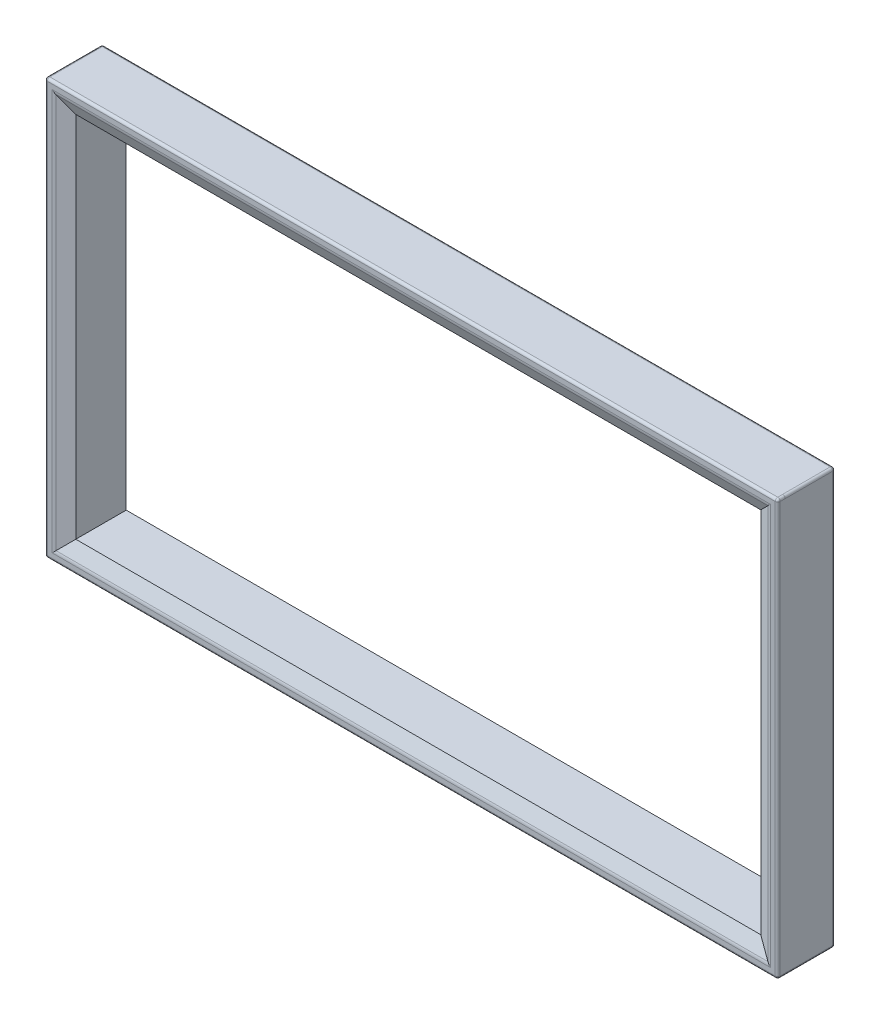
ISO-10303-21;
HEADER;
FILE_DESCRIPTION(('STEP AP214'),'2;1');
FILE_NAME('part.step','',(''),(''),'','','');
FILE_SCHEMA(('AUTOMOTIVE_DESIGN { 1 0 10303 214 1 1 1 1 }'));
ENDSEC;
DATA;
#1=APPLICATION_CONTEXT('core data for automotive mechanical design processes');
#2=APPLICATION_PROTOCOL_DEFINITION('international standard','automotive_design',2000,#1);
#3=PRODUCT_CONTEXT('',#1,'mechanical');
#4=PRODUCT('Part','Part','',(#3));
#5=PRODUCT_RELATED_PRODUCT_CATEGORY('part','',(#4));
#6=PRODUCT_DEFINITION_FORMATION('','',#4);
#7=PRODUCT_DEFINITION_CONTEXT('part definition',#1,'design');
#8=PRODUCT_DEFINITION('design','',#6,#7);
#9=PRODUCT_DEFINITION_SHAPE('','',#8);
#10=(LENGTH_UNIT() NAMED_UNIT(*) SI_UNIT(.MILLI.,.METRE.));
#11=(NAMED_UNIT(*) PLANE_ANGLE_UNIT() SI_UNIT($,.RADIAN.));
#12=(NAMED_UNIT(*) SI_UNIT($,.STERADIAN.) SOLID_ANGLE_UNIT());
#13=UNCERTAINTY_MEASURE_WITH_UNIT(LENGTH_MEASURE(1.E-05),#10,'distance_accuracy_value','');
#14=(GEOMETRIC_REPRESENTATION_CONTEXT(3) GLOBAL_UNCERTAINTY_ASSIGNED_CONTEXT((#13)) GLOBAL_UNIT_ASSIGNED_CONTEXT((#10,
#11,#12)) REPRESENTATION_CONTEXT('',''));
#15=CARTESIAN_POINT('',(0.,0.,0.));
#16=DIRECTION('',(0.,0.,1.));
#17=DIRECTION('',(1.,0.,0.));
#18=AXIS2_PLACEMENT_3D('',#15,#16,#17);
#19=CARTESIAN_POINT('',(0.,0.,423.));
#20=DIRECTION('',(0.,0.,-1.));
#21=DIRECTION('',(-1.,0.,0.));
#22=AXIS2_PLACEMENT_3D('',#19,#20,#21);
#23=PLANE('',#22);
#24=DIRECTION('',(0.,-1.,0.));
#25=VECTOR('',#24,1.);
#26=CARTESIAN_POINT('',(-1524.24781139835,0.,423.));
#27=LINE('',#26,#25);
#28=CARTESIAN_POINT('',(-1524.24781139835,822.873149236193,423.));
#29=VERTEX_POINT('',#28);
#30=CARTESIAN_POINT('',(-1524.24781139835,-823.126850763807,423.));
#31=VERTEX_POINT('',#30);
#32=EDGE_CURVE('E318',#29,#31,#27,.T.);
#33=ORIENTED_EDGE('',*,*,#32,.T.);
#34=DIRECTION('',(1.,0.,0.));
#35=VECTOR('',#34,1.);
#36=CARTESIAN_POINT('',(0.,-823.126850763807,423.));
#37=LINE('',#36,#35);
#38=CARTESIAN_POINT('',(1391.75218860164,-823.126850763807,423.));
#39=VERTEX_POINT('',#38);
#40=EDGE_CURVE('E324',#31,#39,#37,.T.);
#41=ORIENTED_EDGE('',*,*,#40,.T.);
#42=DIRECTION('',(0.,1.,0.));
#43=VECTOR('',#42,1.);
#44=CARTESIAN_POINT('',(1391.75218860164,0.,423.));
#45=LINE('',#44,#43);
#46=CARTESIAN_POINT('',(1391.75218860164,822.873149236193,423.));
#47=VERTEX_POINT('',#46);
#48=EDGE_CURVE('E322',#39,#47,#45,.T.);
#49=ORIENTED_EDGE('',*,*,#48,.T.);
#50=DIRECTION('',(-1.,0.,0.));
#51=VECTOR('',#50,1.);
#52=CARTESIAN_POINT('',(0.,822.873149236193,423.));
#53=LINE('',#52,#51);
#54=EDGE_CURVE('E320',#47,#29,#53,.T.);
#55=ORIENTED_EDGE('',*,*,#54,.T.);
#56=EDGE_LOOP('',(#33,#41,#49,#55));
#57=FACE_BOUND('',#56,.T.);
#58=DIRECTION('',(0.,1.,0.));
#59=VECTOR('',#58,1.);
#60=CARTESIAN_POINT('',(-1504.89865127764,796.873149236193,423.));
#61=LINE('',#60,#59);
#62=CARTESIAN_POINT('',(-1504.89865127764,-803.777690643096,423.));
#63=VERTEX_POINT('',#62);
#64=CARTESIAN_POINT('',(-1504.89865127764,803.523989115481,423.));
#65=VERTEX_POINT('',#64);
#66=EDGE_CURVE('E238',#63,#65,#61,.T.);
#67=ORIENTED_EDGE('',*,*,#66,.T.);
#68=DIRECTION('',(1.,0.,0.));
#69=VECTOR('',#68,1.);
#70=CARTESIAN_POINT('',(1365.75218860164,803.523989115481,423.));
#71=LINE('',#70,#69);
#72=CARTESIAN_POINT('',(1372.40302848093,803.523989115481,423.));
#73=VERTEX_POINT('',#72);
#74=EDGE_CURVE('E254',#65,#73,#71,.T.);
#75=ORIENTED_EDGE('',*,*,#74,.T.);
#76=DIRECTION('',(0.,-1.,0.));
#77=VECTOR('',#76,1.);
#78=CARTESIAN_POINT('',(1372.40302848093,-797.126850763808,423.));
#79=LINE('',#78,#77);
#80=CARTESIAN_POINT('',(1372.40302848093,-803.777690643096,423.));
#81=VERTEX_POINT('',#80);
#82=EDGE_CURVE('E252',#73,#81,#79,.T.);
#83=ORIENTED_EDGE('',*,*,#82,.T.);
#84=DIRECTION('',(-1.,0.,0.));
#85=VECTOR('',#84,1.);
#86=CARTESIAN_POINT('',(-1498.24781139836,-803.777690643096,423.));
#87=LINE('',#86,#85);
#88=EDGE_CURVE('E250',#81,#63,#87,.T.);
#89=ORIENTED_EDGE('',*,*,#88,.T.);
#90=EDGE_LOOP('',(#67,#75,#83,#89));
#91=FACE_BOUND('',#90,.T.);
#92=ADVANCED_FACE('F34',(#57,#91),#23,.F.);
#93=CARTESIAN_POINT('',(1401.75218860164,-833.126850763807,423.));
#94=DIRECTION('',(-1.,0.,0.));
#95=DIRECTION('',(0.,0.,1.));
#96=AXIS2_PLACEMENT_3D('',#93,#94,#95);
#97=PLANE('',#96);
#98=DIRECTION('',(0.,0.,-1.));
#99=VECTOR('',#98,1.);
#100=CARTESIAN_POINT('',(1401.75218860164,-823.126850763807,423.));
#101=LINE('',#100,#99);
#102=CARTESIAN_POINT('',(1401.75218860164,-823.126850763807,413.));
#103=VERTEX_POINT('',#102);
#104=CARTESIAN_POINT('',(1401.75218860164,-823.126850763807,393.));
#105=VERTEX_POINT('',#104);
#106=EDGE_CURVE('E288',#103,#105,#101,.T.);
#107=ORIENTED_EDGE('',*,*,#106,.T.);
#108=DIRECTION('',(0.,0.,1.));
#109=VECTOR('',#108,1.);
#110=CARTESIAN_POINT('',(1401.75218860164,-823.126850763807,423.));
#111=LINE('',#110,#109);
#112=CARTESIAN_POINT('',(1401.75218860164,-823.126850763807,203.));
#113=VERTEX_POINT('',#112);
#114=EDGE_CURVE('E428',#105,#113,#111,.F.);
#115=ORIENTED_EDGE('',*,*,#114,.T.);
#116=DIRECTION('',(0.,-1.,0.));
#117=VECTOR('',#116,1.);
#118=CARTESIAN_POINT('',(1401.75218860164,-833.126850763807,203.));
#119=LINE('',#118,#117);
#120=CARTESIAN_POINT('',(1401.75218860164,822.873149236193,203.));
#121=VERTEX_POINT('',#120);
#122=EDGE_CURVE('E424',#113,#121,#119,.F.);
#123=ORIENTED_EDGE('',*,*,#122,.T.);
#124=DIRECTION('',(0.,0.,1.));
#125=VECTOR('',#124,1.);
#126=CARTESIAN_POINT('',(1401.75218860164,822.873149236193,423.));
#127=LINE('',#126,#125);
#128=CARTESIAN_POINT('',(1401.75218860164,822.873149236193,393.));
#129=VERTEX_POINT('',#128);
#130=EDGE_CURVE('E422',#121,#129,#127,.T.);
#131=ORIENTED_EDGE('',*,*,#130,.T.);
#132=DIRECTION('',(0.,0.,-1.));
#133=VECTOR('',#132,1.);
#134=CARTESIAN_POINT('',(1401.75218860164,822.873149236193,423.));
#135=LINE('',#134,#133);
#136=CARTESIAN_POINT('',(1401.75218860164,822.873149236193,413.));
#137=VERTEX_POINT('',#136);
#138=EDGE_CURVE('E278',#129,#137,#135,.F.);
#139=ORIENTED_EDGE('',*,*,#138,.T.);
#140=DIRECTION('',(0.,1.,0.));
#141=VECTOR('',#140,1.);
#142=CARTESIAN_POINT('',(1401.75218860164,-833.126850763807,413.));
#143=LINE('',#142,#141);
#144=EDGE_CURVE('E266',#137,#103,#143,.F.);
#145=ORIENTED_EDGE('',*,*,#144,.T.);
#146=EDGE_LOOP('',(#107,#115,#123,#131,#139,#145));
#147=FACE_BOUND('',#146,.T.);
#148=ADVANCED_FACE('F481',(#147),#97,.F.);
#149=CARTESIAN_POINT('',(-1534.24781139835,832.873149236193,423.));
#150=DIRECTION('',(0.,-1.,0.));
#151=DIRECTION('',(0.,0.,-1.));
#152=AXIS2_PLACEMENT_3D('',#149,#150,#151);
#153=PLANE('',#152);
#154=DIRECTION('',(0.,0.,-1.));
#155=VECTOR('',#154,1.);
#156=CARTESIAN_POINT('',(1391.75218860164,832.873149236193,423.));
#157=LINE('',#156,#155);
#158=CARTESIAN_POINT('',(1391.75218860164,832.873149236193,413.));
#159=VERTEX_POINT('',#158);
#160=CARTESIAN_POINT('',(1391.75218860164,832.873149236193,393.));
#161=VERTEX_POINT('',#160);
#162=EDGE_CURVE('E317',#159,#161,#157,.T.);
#163=ORIENTED_EDGE('',*,*,#162,.T.);
#164=DIRECTION('',(0.,0.,1.));
#165=VECTOR('',#164,1.);
#166=CARTESIAN_POINT('',(1391.75218860164,832.873149236193,423.));
#167=LINE('',#166,#165);
#168=CARTESIAN_POINT('',(1391.75218860164,832.873149236193,203.));
#169=VERTEX_POINT('',#168);
#170=EDGE_CURVE('E11',#161,#169,#167,.F.);
#171=ORIENTED_EDGE('',*,*,#170,.T.);
#172=DIRECTION('',(1.,0.,0.));
#173=VECTOR('',#172,1.);
#174=CARTESIAN_POINT('',(-1534.24781139835,832.873149236193,203.));
#175=LINE('',#174,#173);
#176=CARTESIAN_POINT('',(-1524.24781139835,832.873149236193,203.));
#177=VERTEX_POINT('',#176);
#178=EDGE_CURVE('E43',#169,#177,#175,.F.);
#179=ORIENTED_EDGE('',*,*,#178,.T.);
#180=DIRECTION('',(0.,0.,1.));
#181=VECTOR('',#180,1.);
#182=CARTESIAN_POINT('',(-1524.24781139835,832.873149236193,423.));
#183=LINE('',#182,#181);
#184=CARTESIAN_POINT('',(-1524.24781139835,832.873149236193,393.));
#185=VERTEX_POINT('',#184);
#186=EDGE_CURVE('E430',#177,#185,#183,.T.);
#187=ORIENTED_EDGE('',*,*,#186,.T.);
#188=DIRECTION('',(0.,0.,-1.));
#189=VECTOR('',#188,1.);
#190=CARTESIAN_POINT('',(-1524.24781139835,832.873149236193,423.));
#191=LINE('',#190,#189);
#192=CARTESIAN_POINT('',(-1524.24781139835,832.873149236193,413.));
#193=VERTEX_POINT('',#192);
#194=EDGE_CURVE('E315',#185,#193,#191,.F.);
#195=ORIENTED_EDGE('',*,*,#194,.T.);
#196=DIRECTION('',(-1.,0.,0.));
#197=VECTOR('',#196,1.);
#198=CARTESIAN_POINT('',(-1534.24781139835,832.873149236193,413.));
#199=LINE('',#198,#197);
#200=EDGE_CURVE('E313',#193,#159,#199,.F.);
#201=ORIENTED_EDGE('',*,*,#200,.T.);
#202=EDGE_LOOP('',(#163,#171,#179,#187,#195,#201));
#203=FACE_BOUND('',#202,.T.);
#204=ADVANCED_FACE('F547',(#203),#153,.F.);
#205=CARTESIAN_POINT('',(-1534.24781139835,-833.126850763807,423.));
#206=DIRECTION('',(1.,0.,0.));
#207=DIRECTION('',(0.,0.,-1.));
#208=AXIS2_PLACEMENT_3D('',#205,#206,#207);
#209=PLANE('',#208);
#210=DIRECTION('',(0.,1.,0.));
#211=VECTOR('',#210,1.);
#212=CARTESIAN_POINT('',(-1534.24781139835,-833.126850763807,203.));
#213=LINE('',#212,#211);
#214=CARTESIAN_POINT('',(-1534.24781139835,822.873149236193,203.));
#215=VERTEX_POINT('',#214);
#216=CARTESIAN_POINT('',(-1534.24781139835,-823.126850763807,203.));
#217=VERTEX_POINT('',#216);
#218=EDGE_CURVE('E389',#215,#217,#213,.F.);
#219=ORIENTED_EDGE('',*,*,#218,.T.);
#220=DIRECTION('',(0.,0.,1.));
#221=VECTOR('',#220,1.);
#222=CARTESIAN_POINT('',(-1534.24781139835,-823.126850763807,423.));
#223=LINE('',#222,#221);
#224=CARTESIAN_POINT('',(-1534.24781139835,-823.126850763807,393.));
#225=VERTEX_POINT('',#224);
#226=EDGE_CURVE('E391',#217,#225,#223,.T.);
#227=ORIENTED_EDGE('',*,*,#226,.T.);
#228=DIRECTION('',(0.,0.,-1.));
#229=VECTOR('',#228,1.);
#230=CARTESIAN_POINT('',(-1534.24781139835,-823.126850763807,423.));
#231=LINE('',#230,#229);
#232=CARTESIAN_POINT('',(-1534.24781139835,-823.126850763807,413.));
#233=VERTEX_POINT('',#232);
#234=EDGE_CURVE('E291',#225,#233,#231,.F.);
#235=ORIENTED_EDGE('',*,*,#234,.T.);
#236=DIRECTION('',(0.,-1.,0.));
#237=VECTOR('',#236,1.);
#238=CARTESIAN_POINT('',(-1534.24781139835,-833.126850763807,413.));
#239=LINE('',#238,#237);
#240=CARTESIAN_POINT('',(-1534.24781139835,822.873149236193,413.));
#241=VERTEX_POINT('',#240);
#242=EDGE_CURVE('E294',#233,#241,#239,.F.);
#243=ORIENTED_EDGE('',*,*,#242,.T.);
#244=DIRECTION('',(0.,0.,-1.));
#245=VECTOR('',#244,1.);
#246=CARTESIAN_POINT('',(-1534.24781139835,822.873149236193,423.));
#247=LINE('',#246,#245);
#248=CARTESIAN_POINT('',(-1534.24781139835,822.873149236193,393.));
#249=VERTEX_POINT('',#248);
#250=EDGE_CURVE('E293',#241,#249,#247,.T.);
#251=ORIENTED_EDGE('',*,*,#250,.T.);
#252=DIRECTION('',(0.,0.,1.));
#253=VECTOR('',#252,1.);
#254=CARTESIAN_POINT('',(-1534.24781139835,822.873149236193,423.));
#255=LINE('',#254,#253);
#256=EDGE_CURVE('E327',#249,#215,#255,.F.);
#257=ORIENTED_EDGE('',*,*,#256,.T.);
#258=EDGE_LOOP('',(#219,#227,#235,#243,#251,#257));
#259=FACE_BOUND('',#258,.T.);
#260=ADVANCED_FACE('F376',(#259),#209,.F.);
#261=CARTESIAN_POINT('',(-1534.24781139835,-833.126850763807,423.));
#262=DIRECTION('',(0.,1.,0.));
#263=DIRECTION('',(0.,0.,1.));
#264=AXIS2_PLACEMENT_3D('',#261,#262,#263);
#265=PLANE('',#264);
#266=DIRECTION('',(0.,0.,-1.));
#267=VECTOR('',#266,1.);
#268=CARTESIAN_POINT('',(-1524.24781139835,-833.126850763807,423.));
#269=LINE('',#268,#267);
#270=CARTESIAN_POINT('',(-1524.24781139835,-833.126850763807,413.));
#271=VERTEX_POINT('',#270);
#272=CARTESIAN_POINT('',(-1524.24781139835,-833.126850763807,393.));
#273=VERTEX_POINT('',#272);
#274=EDGE_CURVE('E297',#271,#273,#269,.T.);
#275=ORIENTED_EDGE('',*,*,#274,.T.);
#276=DIRECTION('',(0.,0.,1.));
#277=VECTOR('',#276,1.);
#278=CARTESIAN_POINT('',(-1524.24781139835,-833.126850763807,423.));
#279=LINE('',#278,#277);
#280=CARTESIAN_POINT('',(-1524.24781139835,-833.126850763807,203.));
#281=VERTEX_POINT('',#280);
#282=EDGE_CURVE('E409',#273,#281,#279,.F.);
#283=ORIENTED_EDGE('',*,*,#282,.T.);
#284=DIRECTION('',(-1.,0.,0.));
#285=VECTOR('',#284,1.);
#286=CARTESIAN_POINT('',(-1534.24781139835,-833.126850763807,203.));
#287=LINE('',#286,#285);
#288=CARTESIAN_POINT('',(1391.75218860164,-833.126850763807,203.));
#289=VERTEX_POINT('',#288);
#290=EDGE_CURVE('E405',#281,#289,#287,.F.);
#291=ORIENTED_EDGE('',*,*,#290,.T.);
#292=DIRECTION('',(0.,0.,1.));
#293=VECTOR('',#292,1.);
#294=CARTESIAN_POINT('',(1391.75218860164,-833.126850763807,423.));
#295=LINE('',#294,#293);
#296=CARTESIAN_POINT('',(1391.75218860164,-833.126850763807,393.));
#297=VERTEX_POINT('',#296);
#298=EDGE_CURVE('E401',#289,#297,#295,.T.);
#299=ORIENTED_EDGE('',*,*,#298,.T.);
#300=DIRECTION('',(0.,0.,-1.));
#301=VECTOR('',#300,1.);
#302=CARTESIAN_POINT('',(1391.75218860164,-833.126850763807,423.));
#303=LINE('',#302,#301);
#304=CARTESIAN_POINT('',(1391.75218860164,-833.126850763807,413.));
#305=VERTEX_POINT('',#304);
#306=EDGE_CURVE('E299',#297,#305,#303,.F.);
#307=ORIENTED_EDGE('',*,*,#306,.T.);
#308=DIRECTION('',(1.,0.,0.));
#309=VECTOR('',#308,1.);
#310=CARTESIAN_POINT('',(-1534.24781139835,-833.126850763807,413.));
#311=LINE('',#310,#309);
#312=EDGE_CURVE('E300',#305,#271,#311,.F.);
#313=ORIENTED_EDGE('',*,*,#312,.T.);
#314=EDGE_LOOP('',(#275,#283,#291,#299,#307,#313));
#315=FACE_BOUND('',#314,.T.);
#316=ADVANCED_FACE('F554',(#315),#265,.F.);
#317=CARTESIAN_POINT('',(1305.75218860164,-737.126850763807,423.));
#318=DIRECTION('',(-1.,0.,0.));
#319=DIRECTION('',(0.,0.,1.));
#320=AXIS2_PLACEMENT_3D('',#317,#318,#319);
#321=PLANE('',#320);
#322=DIRECTION('',(0.,0.,-1.));
#323=VECTOR('',#322,1.);
#324=CARTESIAN_POINT('',(1305.75218860164,-737.126850763807,423.));
#325=LINE('',#324,#323);
#326=CARTESIAN_POINT('',(1305.75218860164,-737.126850763807,395.0215405107));
#327=VERTEX_POINT('',#326);
#328=CARTESIAN_POINT('',(1305.75218860164,-737.126850763807,193.));
#329=VERTEX_POINT('',#328);
#330=EDGE_CURVE('E194',#327,#329,#325,.T.);
#331=ORIENTED_EDGE('',*,*,#330,.F.);
#332=DIRECTION('',(0.,1.,0.));
#333=VECTOR('',#332,1.);
#334=CARTESIAN_POINT('',(1305.75218860164,736.873149236193,395.0215405107));
#335=LINE('',#334,#333);
#336=CARTESIAN_POINT('',(1305.75218860164,736.873149236193,395.0215405107));
#337=VERTEX_POINT('',#336);
#338=EDGE_CURVE('E235',#327,#337,#335,.T.);
#339=ORIENTED_EDGE('',*,*,#338,.T.);
#340=DIRECTION('',(0.,0.,-1.));
#341=VECTOR('',#340,1.);
#342=CARTESIAN_POINT('',(1305.75218860164,736.873149236193,423.));
#343=LINE('',#342,#341);
#344=CARTESIAN_POINT('',(1305.75218860164,736.873149236193,193.));
#345=VERTEX_POINT('',#344);
#346=EDGE_CURVE('E212',#337,#345,#343,.T.);
#347=ORIENTED_EDGE('',*,*,#346,.T.);
#348=DIRECTION('',(0.,-1.,0.));
#349=VECTOR('',#348,1.);
#350=CARTESIAN_POINT('',(1305.75218860164,-737.126850763807,193.));
#351=LINE('',#350,#349);
#352=EDGE_CURVE('E209',#345,#329,#351,.T.);
#353=ORIENTED_EDGE('',*,*,#352,.T.);
#354=EDGE_LOOP('',(#331,#339,#347,#353));
#355=FACE_BOUND('',#354,.T.);
#356=ADVANCED_FACE('F210',(#355),#321,.T.);
#357=CARTESIAN_POINT('',(-1438.24781139836,736.873149236193,423.));
#358=DIRECTION('',(0.,-1.,0.));
#359=DIRECTION('',(0.,0.,-1.));
#360=AXIS2_PLACEMENT_3D('',#357,#358,#359);
#361=PLANE('',#360);
#362=ORIENTED_EDGE('',*,*,#346,.F.);
#363=DIRECTION('',(-1.,0.,0.));
#364=VECTOR('',#363,1.);
#365=CARTESIAN_POINT('',(-1438.24781139836,736.873149236193,395.0215405107));
#366=LINE('',#365,#364);
#367=CARTESIAN_POINT('',(-1438.24781139836,736.873149236193,395.0215405107));
#368=VERTEX_POINT('',#367);
#369=EDGE_CURVE('E233',#337,#368,#366,.T.);
#370=ORIENTED_EDGE('',*,*,#369,.T.);
#371=DIRECTION('',(0.,0.,-1.));
#372=VECTOR('',#371,1.);
#373=CARTESIAN_POINT('',(-1438.24781139836,736.873149236193,423.));
#374=LINE('',#373,#372);
#375=CARTESIAN_POINT('',(-1438.24781139835,736.873149236193,193.));
#376=VERTEX_POINT('',#375);
#377=EDGE_CURVE('E227',#368,#376,#374,.T.);
#378=ORIENTED_EDGE('',*,*,#377,.T.);
#379=DIRECTION('',(1.,0.,0.));
#380=VECTOR('',#379,1.);
#381=CARTESIAN_POINT('',(-1438.24781139835,736.873149236193,193.));
#382=LINE('',#381,#380);
#383=EDGE_CURVE('E221',#376,#345,#382,.T.);
#384=ORIENTED_EDGE('',*,*,#383,.T.);
#385=EDGE_LOOP('',(#362,#370,#378,#384));
#386=FACE_BOUND('',#385,.T.);
#387=ADVANCED_FACE('F571',(#386),#361,.T.);
#388=CARTESIAN_POINT('',(-1438.24781139836,-737.126850763807,423.));
#389=DIRECTION('',(1.,0.,0.));
#390=DIRECTION('',(0.,0.,-1.));
#391=AXIS2_PLACEMENT_3D('',#388,#389,#390);
#392=PLANE('',#391);
#393=ORIENTED_EDGE('',*,*,#377,.F.);
#394=DIRECTION('',(0.,-1.,0.));
#395=VECTOR('',#394,1.);
#396=CARTESIAN_POINT('',(-1438.24781139836,-737.126850763807,395.0215405107));
#397=LINE('',#396,#395);
#398=CARTESIAN_POINT('',(-1438.24781139836,-737.126850763807,395.0215405107));
#399=VERTEX_POINT('',#398);
#400=EDGE_CURVE('E230',#368,#399,#397,.T.);
#401=ORIENTED_EDGE('',*,*,#400,.T.);
#402=DIRECTION('',(0.,0.,-1.));
#403=VECTOR('',#402,1.);
#404=CARTESIAN_POINT('',(-1438.24781139836,-737.126850763807,423.));
#405=LINE('',#404,#403);
#406=CARTESIAN_POINT('',(-1438.24781139835,-737.126850763807,193.));
#407=VERTEX_POINT('',#406);
#408=EDGE_CURVE('E205',#399,#407,#405,.T.);
#409=ORIENTED_EDGE('',*,*,#408,.T.);
#410=DIRECTION('',(0.,1.,0.));
#411=VECTOR('',#410,1.);
#412=CARTESIAN_POINT('',(-1438.24781139835,-737.126850763807,193.));
#413=LINE('',#412,#411);
#414=EDGE_CURVE('E219',#407,#376,#413,.T.);
#415=ORIENTED_EDGE('',*,*,#414,.T.);
#416=EDGE_LOOP('',(#393,#401,#409,#415));
#417=FACE_BOUND('',#416,.T.);
#418=ADVANCED_FACE('F712',(#417),#392,.T.);
#419=CARTESIAN_POINT('',(-1438.24781139836,-737.126850763807,423.));
#420=DIRECTION('',(0.,1.,0.));
#421=DIRECTION('',(0.,0.,1.));
#422=AXIS2_PLACEMENT_3D('',#419,#420,#421);
#423=PLANE('',#422);
#424=ORIENTED_EDGE('',*,*,#408,.F.);
#425=DIRECTION('',(1.,0.,0.));
#426=VECTOR('',#425,1.);
#427=CARTESIAN_POINT('',(1305.75218860164,-737.126850763807,395.0215405107));
#428=LINE('',#427,#426);
#429=EDGE_CURVE('E202',#399,#327,#428,.T.);
#430=ORIENTED_EDGE('',*,*,#429,.T.);
#431=ORIENTED_EDGE('',*,*,#330,.T.);
#432=DIRECTION('',(-1.,0.,0.));
#433=VECTOR('',#432,1.);
#434=CARTESIAN_POINT('',(-1438.24781139835,-737.126850763807,193.));
#435=LINE('',#434,#433);
#436=EDGE_CURVE('E199',#329,#407,#435,.T.);
#437=ORIENTED_EDGE('',*,*,#436,.T.);
#438=EDGE_LOOP('',(#424,#430,#431,#437));
#439=FACE_BOUND('',#438,.T.);
#440=ADVANCED_FACE('F197',(#439),#423,.T.);
#441=CARTESIAN_POINT('',(1305.75218860164,-737.126850763807,395.0215405107));
#442=DIRECTION('',(-0.422618261740698,0.,0.906307787036651));
#443=DIRECTION('',(0.,-1.,0.));
#444=AXIS2_PLACEMENT_3D('',#441,#442,#443);
#445=PLANE('',#444);
#446=DIRECTION('',(-0.671542934237818,0.671542934237818,-0.313145613014972));
#447=VECTOR('',#446,1.);
#448=CARTESIAN_POINT('',(1305.75218860164,-737.126850763807,395.0215405107));
#449=LINE('',#448,#447);
#450=CARTESIAN_POINT('',(1359.72448062871,-791.099142790875,420.189233611099));
#451=VERTEX_POINT('',#450);
#452=EDGE_CURVE('E245',#451,#327,#449,.T.);
#453=ORIENTED_EDGE('',*,*,#452,.F.);
#454=DIRECTION('',(0.,-1.,0.));
#455=VECTOR('',#454,1.);
#456=CARTESIAN_POINT('',(1359.72448062871,796.873149236193,420.1892336111));
#457=LINE('',#456,#455);
#458=CARTESIAN_POINT('',(1359.72448062871,790.845441263261,420.189233611099));
#459=VERTEX_POINT('',#458);
#460=EDGE_CURVE('E260',#451,#459,#457,.F.);
#461=ORIENTED_EDGE('',*,*,#460,.T.);
#462=DIRECTION('',(-0.671542934237818,-0.671542934237818,-0.313145613014972));
#463=VECTOR('',#462,1.);
#464=CARTESIAN_POINT('',(68.2907486337609,-500.58829073169,-182.016205617833));
#465=LINE('',#464,#463);
#466=EDGE_CURVE('E206',#337,#459,#465,.F.);
#467=ORIENTED_EDGE('',*,*,#466,.F.);
#468=ORIENTED_EDGE('',*,*,#338,.F.);
#469=EDGE_LOOP('',(#453,#461,#467,#468));
#470=FACE_BOUND('',#469,.T.);
#471=ADVANCED_FACE('F711',(#470),#445,.T.);
#472=CARTESIAN_POINT('',(-1438.24781139836,736.873149236193,395.0215405107));
#473=DIRECTION('',(0.,-0.422618261740698,0.906307787036651));
#474=DIRECTION('',(1.,0.,0.));
#475=AXIS2_PLACEMENT_3D('',#472,#473,#474);
#476=PLANE('',#475);
#477=ORIENTED_EDGE('',*,*,#466,.T.);
#478=DIRECTION('',(1.,0.,0.));
#479=VECTOR('',#478,1.);
#480=CARTESIAN_POINT('',(-1498.24781139836,790.84544126326,420.189233611099));
#481=LINE('',#480,#479);
#482=CARTESIAN_POINT('',(-1492.22010342542,790.84544126326,420.189233611099));
#483=VERTEX_POINT('',#482);
#484=EDGE_CURVE('E257',#459,#483,#481,.F.);
#485=ORIENTED_EDGE('',*,*,#484,.T.);
#486=DIRECTION('',(0.671542934237818,-0.671542934237818,-0.313145613014972));
#487=VECTOR('',#486,1.);
#488=CARTESIAN_POINT('',(-773.51816033689,72.1434981747278,85.0530136180404));
#489=LINE('',#488,#487);
#490=EDGE_CURVE('E241',#368,#483,#489,.F.);
#491=ORIENTED_EDGE('',*,*,#490,.F.);
#492=ORIENTED_EDGE('',*,*,#369,.F.);
#493=EDGE_LOOP('',(#477,#485,#491,#492));
#494=FACE_BOUND('',#493,.T.);
#495=ADVANCED_FACE('F840',(#494),#476,.T.);
#496=CARTESIAN_POINT('',(-1438.24781139836,-737.126850763807,395.0215405107));
#497=DIRECTION('',(0.,0.422618261740698,0.906307787036651));
#498=DIRECTION('',(-1.,0.,0.));
#499=AXIS2_PLACEMENT_3D('',#496,#497,#498);
#500=PLANE('',#499);
#501=DIRECTION('',(-0.671542934237818,-0.671542934237818,0.313145613014972));
#502=VECTOR('',#501,1.);
#503=CARTESIAN_POINT('',(-1438.24781139836,-737.126850763807,395.0215405107));
#504=LINE('',#503,#502);
#505=CARTESIAN_POINT('',(-1492.22010342542,-791.099142790875,420.189233611099));
#506=VERTEX_POINT('',#505);
#507=EDGE_CURVE('E239',#506,#399,#504,.F.);
#508=ORIENTED_EDGE('',*,*,#507,.F.);
#509=DIRECTION('',(-1.,0.,0.));
#510=VECTOR('',#509,1.);
#511=CARTESIAN_POINT('',(1365.75218860164,-791.099142790875,420.189233611099));
#512=LINE('',#511,#510);
#513=EDGE_CURVE('E262',#506,#451,#512,.F.);
#514=ORIENTED_EDGE('',*,*,#513,.T.);
#515=ORIENTED_EDGE('',*,*,#452,.T.);
#516=ORIENTED_EDGE('',*,*,#429,.F.);
#517=EDGE_LOOP('',(#508,#514,#515,#516));
#518=FACE_BOUND('',#517,.T.);
#519=ADVANCED_FACE('F830',(#518),#500,.T.);
#520=CARTESIAN_POINT('',(-1438.24781139836,-737.126850763807,395.0215405107));
#521=DIRECTION('',(0.422618261740698,0.,0.906307787036651));
#522=DIRECTION('',(0.,1.,0.));
#523=AXIS2_PLACEMENT_3D('',#520,#521,#522);
#524=PLANE('',#523);
#525=ORIENTED_EDGE('',*,*,#490,.T.);
#526=DIRECTION('',(0.,1.,0.));
#527=VECTOR('',#526,1.);
#528=CARTESIAN_POINT('',(-1492.22010342542,-797.126850763808,420.189233611099));
#529=LINE('',#528,#527);
#530=EDGE_CURVE('E264',#483,#506,#529,.F.);
#531=ORIENTED_EDGE('',*,*,#530,.T.);
#532=ORIENTED_EDGE('',*,*,#507,.T.);
#533=ORIENTED_EDGE('',*,*,#400,.F.);
#534=EDGE_LOOP('',(#525,#531,#532,#533));
#535=FACE_BOUND('',#534,.T.);
#536=ADVANCED_FACE('F821',(#535),#524,.T.);
#537=CARTESIAN_POINT('',(0.,-803.777690643096,393.));
#538=DIRECTION('',(1.,0.,0.));
#539=DIRECTION('',(0.,0.,-1.));
#540=AXIS2_PLACEMENT_3D('',#537,#538,#539);
#541=CYLINDRICAL_SURFACE('',#540,30.);
#542=CARTESIAN_POINT('',(1372.40302848093,-803.777690643096,393.));
#543=DIRECTION('',(0.707106781186547,0.707106781186547,0.));
#544=DIRECTION('',(-0.707106781186547,0.707106781186547,0.));
#545=AXIS2_PLACEMENT_3D('',#542,#543,#544);
#546=ELLIPSE('',#545,42.4264068711928,30.);
#547=EDGE_CURVE('E272',#451,#81,#546,.T.);
#548=ORIENTED_EDGE('',*,*,#547,.F.);
#549=ORIENTED_EDGE('',*,*,#513,.F.);
#550=CARTESIAN_POINT('',(-1504.89865127764,-803.777690643096,393.));
#551=DIRECTION('',(0.707106781186547,-0.707106781186547,0.));
#552=DIRECTION('',(0.707106781186547,0.707106781186547,0.));
#553=AXIS2_PLACEMENT_3D('',#550,#551,#552);
#554=ELLIPSE('',#553,42.4264068711928,30.);
#555=EDGE_CURVE('E242',#63,#506,#554,.F.);
#556=ORIENTED_EDGE('',*,*,#555,.F.);
#557=ORIENTED_EDGE('',*,*,#88,.F.);
#558=EDGE_LOOP('',(#548,#549,#556,#557));
#559=FACE_BOUND('',#558,.T.);
#560=ADVANCED_FACE('F590',(#559),#541,.T.);
#561=CARTESIAN_POINT('',(-1504.89865127764,0.,393.));
#562=DIRECTION('',(0.,-1.,0.));
#563=DIRECTION('',(0.,0.,-1.));
#564=AXIS2_PLACEMENT_3D('',#561,#562,#563);
#565=CYLINDRICAL_SURFACE('',#564,30.);
#566=ORIENTED_EDGE('',*,*,#555,.T.);
#567=ORIENTED_EDGE('',*,*,#530,.F.);
#568=CARTESIAN_POINT('',(-1504.89865127764,803.523989115481,393.));
#569=DIRECTION('',(-0.707106781186547,-0.707106781186547,0.));
#570=DIRECTION('',(-0.707106781186547,0.707106781186547,0.));
#571=AXIS2_PLACEMENT_3D('',#568,#569,#570);
#572=ELLIPSE('',#571,42.4264068711928,30.);
#573=EDGE_CURVE('E269',#65,#483,#572,.F.);
#574=ORIENTED_EDGE('',*,*,#573,.F.);
#575=ORIENTED_EDGE('',*,*,#66,.F.);
#576=EDGE_LOOP('',(#566,#567,#574,#575));
#577=FACE_BOUND('',#576,.T.);
#578=ADVANCED_FACE('F803',(#577),#565,.T.);
#579=CARTESIAN_POINT('',(1372.40302848093,0.,393.));
#580=DIRECTION('',(0.,1.,0.));
#581=DIRECTION('',(0.,0.,1.));
#582=AXIS2_PLACEMENT_3D('',#579,#580,#581);
#583=CYLINDRICAL_SURFACE('',#582,30.);
#584=ORIENTED_EDGE('',*,*,#547,.T.);
#585=ORIENTED_EDGE('',*,*,#82,.F.);
#586=CARTESIAN_POINT('',(1372.40302848093,803.523989115481,393.));
#587=DIRECTION('',(-0.707106781186547,0.707106781186547,0.));
#588=DIRECTION('',(-0.707106781186547,-0.707106781186547,0.));
#589=AXIS2_PLACEMENT_3D('',#586,#587,#588);
#590=ELLIPSE('',#589,42.4264068711928,30.);
#591=EDGE_CURVE('E267',#459,#73,#590,.T.);
#592=ORIENTED_EDGE('',*,*,#591,.F.);
#593=ORIENTED_EDGE('',*,*,#460,.F.);
#594=EDGE_LOOP('',(#584,#585,#592,#593));
#595=FACE_BOUND('',#594,.T.);
#596=ADVANCED_FACE('F793',(#595),#583,.T.);
#597=CARTESIAN_POINT('',(0.,803.523989115481,393.));
#598=DIRECTION('',(-1.,0.,0.));
#599=DIRECTION('',(0.,0.,1.));
#600=AXIS2_PLACEMENT_3D('',#597,#598,#599);
#601=CYLINDRICAL_SURFACE('',#600,30.);
#602=ORIENTED_EDGE('',*,*,#573,.T.);
#603=ORIENTED_EDGE('',*,*,#484,.F.);
#604=ORIENTED_EDGE('',*,*,#591,.T.);
#605=ORIENTED_EDGE('',*,*,#74,.F.);
#606=EDGE_LOOP('',(#602,#603,#604,#605));
#607=FACE_BOUND('',#606,.T.);
#608=ADVANCED_FACE('F613',(#607),#601,.T.);
#609=CARTESIAN_POINT('',(-1524.24781139835,822.873149236193,423.));
#610=DIRECTION('',(0.,0.,-1.));
#611=DIRECTION('',(-1.,0.,0.));
#612=AXIS2_PLACEMENT_3D('',#609,#610,#611);
#613=CYLINDRICAL_SURFACE('',#612,10.);
#614=CARTESIAN_POINT('',(-1524.24781139835,822.873149236193,413.));
#615=DIRECTION('',(0.,0.,1.));
#616=DIRECTION('',(1.,0.,0.));
#617=AXIS2_PLACEMENT_3D('',#614,#615,#616);
#618=CIRCLE('',#617,10.);
#619=EDGE_CURVE('E270',#193,#241,#618,.T.);
#620=ORIENTED_EDGE('',*,*,#619,.F.);
#621=ORIENTED_EDGE('',*,*,#194,.F.);
#622=CARTESIAN_POINT('',(-1524.24781139835,822.873149236193,393.));
#623=DIRECTION('',(0.,0.,-1.));
#624=DIRECTION('',(-1.,0.,0.));
#625=AXIS2_PLACEMENT_3D('',#622,#623,#624);
#626=CIRCLE('',#625,10.);
#627=EDGE_CURVE('E287',#249,#185,#626,.T.);
#628=ORIENTED_EDGE('',*,*,#627,.F.);
#629=ORIENTED_EDGE('',*,*,#250,.F.);
#630=EDGE_LOOP('',(#620,#621,#628,#629));
#631=FACE_BOUND('',#630,.T.);
#632=ADVANCED_FACE('F383',(#631),#613,.T.);
#633=CARTESIAN_POINT('',(-1524.24781139835,822.873149236193,413.));
#634=DIRECTION('',(0.,0.,1.));
#635=DIRECTION('',(1.,0.,0.));
#636=AXIS2_PLACEMENT_3D('',#633,#634,#635);
#637=SPHERICAL_SURFACE('',#636,10.);
#638=CARTESIAN_POINT('',(-1524.24781139835,822.873149236193,413.));
#639=DIRECTION('',(-1.,0.,0.));
#640=DIRECTION('',(0.,0.,1.));
#641=AXIS2_PLACEMENT_3D('',#638,#639,#640);
#642=CIRCLE('',#641,10.);
#643=EDGE_CURVE('E353',#193,#29,#642,.F.);
#644=ORIENTED_EDGE('',*,*,#643,.F.);
#645=ORIENTED_EDGE('',*,*,#619,.T.);
#646=CARTESIAN_POINT('',(-1524.24781139835,822.873149236193,413.));
#647=DIRECTION('',(0.,1.,0.));
#648=DIRECTION('',(0.,0.,1.));
#649=AXIS2_PLACEMENT_3D('',#646,#647,#648);
#650=CIRCLE('',#649,10.);
#651=EDGE_CURVE('E356',#29,#241,#650,.F.);
#652=ORIENTED_EDGE('',*,*,#651,.F.);
#653=EDGE_LOOP('',(#644,#645,#652));
#654=FACE_BOUND('',#653,.T.);
#655=ADVANCED_FACE('F542',(#654),#637,.T.);
#656=CARTESIAN_POINT('',(-1524.24781139835,-823.126850763807,423.));
#657=DIRECTION('',(0.,0.,-1.));
#658=DIRECTION('',(-1.,0.,0.));
#659=AXIS2_PLACEMENT_3D('',#656,#657,#658);
#660=CYLINDRICAL_SURFACE('',#659,10.);
#661=CARTESIAN_POINT('',(-1524.24781139835,-823.126850763807,393.));
#662=DIRECTION('',(0.,0.,-1.));
#663=DIRECTION('',(-1.,0.,0.));
#664=AXIS2_PLACEMENT_3D('',#661,#662,#663);
#665=CIRCLE('',#664,10.);
#666=EDGE_CURVE('E284',#273,#225,#665,.T.);
#667=ORIENTED_EDGE('',*,*,#666,.F.);
#668=ORIENTED_EDGE('',*,*,#274,.F.);
#669=CARTESIAN_POINT('',(-1524.24781139835,-823.126850763807,413.));
#670=DIRECTION('',(0.,0.,1.));
#671=DIRECTION('',(1.,0.,0.));
#672=AXIS2_PLACEMENT_3D('',#669,#670,#671);
#673=CIRCLE('',#672,10.);
#674=EDGE_CURVE('E350',#233,#271,#673,.T.);
#675=ORIENTED_EDGE('',*,*,#674,.F.);
#676=ORIENTED_EDGE('',*,*,#234,.F.);
#677=EDGE_LOOP('',(#667,#668,#675,#676));
#678=FACE_BOUND('',#677,.T.);
#679=ADVANCED_FACE('F528',(#678),#660,.T.);
#680=CARTESIAN_POINT('',(-1524.24781139835,0.,413.));
#681=DIRECTION('',(0.,-1.,0.));
#682=DIRECTION('',(0.,0.,-1.));
#683=AXIS2_PLACEMENT_3D('',#680,#681,#682);
#684=CYLINDRICAL_SURFACE('',#683,10.);
#685=ORIENTED_EDGE('',*,*,#651,.T.);
#686=ORIENTED_EDGE('',*,*,#242,.F.);
#687=CARTESIAN_POINT('',(-1524.24781139835,-823.126850763807,413.));
#688=DIRECTION('',(0.,-1.,0.));
#689=DIRECTION('',(0.,0.,-1.));
#690=AXIS2_PLACEMENT_3D('',#687,#688,#689);
#691=CIRCLE('',#690,10.);
#692=EDGE_CURVE('E347',#31,#233,#691,.T.);
#693=ORIENTED_EDGE('',*,*,#692,.F.);
#694=ORIENTED_EDGE('',*,*,#32,.F.);
#695=EDGE_LOOP('',(#685,#686,#693,#694));
#696=FACE_BOUND('',#695,.T.);
#697=ADVANCED_FACE('F538',(#696),#684,.T.);
#698=CARTESIAN_POINT('',(0.,822.873149236193,413.));
#699=DIRECTION('',(-1.,0.,0.));
#700=DIRECTION('',(0.,0.,1.));
#701=AXIS2_PLACEMENT_3D('',#698,#699,#700);
#702=CYLINDRICAL_SURFACE('',#701,10.);
#703=ORIENTED_EDGE('',*,*,#643,.T.);
#704=ORIENTED_EDGE('',*,*,#54,.F.);
#705=CARTESIAN_POINT('',(1391.75218860164,822.873149236193,413.));
#706=DIRECTION('',(1.,0.,0.));
#707=DIRECTION('',(0.,0.,-1.));
#708=AXIS2_PLACEMENT_3D('',#705,#706,#707);
#709=CIRCLE('',#708,10.);
#710=EDGE_CURVE('E344',#159,#47,#709,.T.);
#711=ORIENTED_EDGE('',*,*,#710,.F.);
#712=ORIENTED_EDGE('',*,*,#200,.F.);
#713=EDGE_LOOP('',(#703,#704,#711,#712));
#714=FACE_BOUND('',#713,.T.);
#715=ADVANCED_FACE('F546',(#714),#702,.T.);
#716=CARTESIAN_POINT('',(1391.75218860164,822.873149236193,423.));
#717=DIRECTION('',(0.,0.,-1.));
#718=DIRECTION('',(-1.,0.,0.));
#719=AXIS2_PLACEMENT_3D('',#716,#717,#718);
#720=CYLINDRICAL_SURFACE('',#719,10.);
#721=CARTESIAN_POINT('',(1391.75218860164,822.873149236193,393.));
#722=DIRECTION('',(0.,0.,-1.));
#723=DIRECTION('',(-1.,0.,0.));
#724=AXIS2_PLACEMENT_3D('',#721,#722,#723);
#725=CIRCLE('',#724,10.);
#726=EDGE_CURVE('E307',#161,#129,#725,.T.);
#727=ORIENTED_EDGE('',*,*,#726,.F.);
#728=ORIENTED_EDGE('',*,*,#162,.F.);
#729=CARTESIAN_POINT('',(1391.75218860164,822.873149236193,413.));
#730=DIRECTION('',(0.,0.,1.));
#731=DIRECTION('',(1.,0.,0.));
#732=AXIS2_PLACEMENT_3D('',#729,#730,#731);
#733=CIRCLE('',#732,10.);
#734=EDGE_CURVE('E341',#137,#159,#733,.T.);
#735=ORIENTED_EDGE('',*,*,#734,.F.);
#736=ORIENTED_EDGE('',*,*,#138,.F.);
#737=EDGE_LOOP('',(#727,#728,#735,#736));
#738=FACE_BOUND('',#737,.T.);
#739=ADVANCED_FACE('F484',(#738),#720,.T.);
#740=CARTESIAN_POINT('',(-1524.24781139835,-823.126850763807,413.));
#741=DIRECTION('',(0.,0.,1.));
#742=DIRECTION('',(1.,0.,0.));
#743=AXIS2_PLACEMENT_3D('',#740,#741,#742);
#744=SPHERICAL_SURFACE('',#743,10.);
#745=ORIENTED_EDGE('',*,*,#692,.T.);
#746=ORIENTED_EDGE('',*,*,#674,.T.);
#747=CARTESIAN_POINT('',(-1524.24781139835,-823.126850763807,413.));
#748=DIRECTION('',(-1.,0.,0.));
#749=DIRECTION('',(0.,0.,1.));
#750=AXIS2_PLACEMENT_3D('',#747,#748,#749);
#751=CIRCLE('',#750,10.);
#752=EDGE_CURVE('E338',#31,#271,#751,.F.);
#753=ORIENTED_EDGE('',*,*,#752,.F.);
#754=EDGE_LOOP('',(#745,#746,#753));
#755=FACE_BOUND('',#754,.T.);
#756=ADVANCED_FACE('F534',(#755),#744,.T.);
#757=CARTESIAN_POINT('',(1391.75218860164,822.873149236193,413.));
#758=DIRECTION('',(0.,0.,1.));
#759=DIRECTION('',(1.,0.,0.));
#760=AXIS2_PLACEMENT_3D('',#757,#758,#759);
#761=SPHERICAL_SURFACE('',#760,10.);
#762=ORIENTED_EDGE('',*,*,#734,.T.);
#763=ORIENTED_EDGE('',*,*,#710,.T.);
#764=CARTESIAN_POINT('',(1391.75218860164,822.873149236193,413.));
#765=DIRECTION('',(0.,1.,0.));
#766=DIRECTION('',(0.,0.,1.));
#767=AXIS2_PLACEMENT_3D('',#764,#765,#766);
#768=CIRCLE('',#767,10.);
#769=EDGE_CURVE('E335',#137,#47,#768,.F.);
#770=ORIENTED_EDGE('',*,*,#769,.F.);
#771=EDGE_LOOP('',(#762,#763,#770));
#772=FACE_BOUND('',#771,.T.);
#773=ADVANCED_FACE('F490',(#772),#761,.T.);
#774=CARTESIAN_POINT('',(0.,-823.126850763807,413.));
#775=DIRECTION('',(1.,0.,0.));
#776=DIRECTION('',(0.,0.,-1.));
#777=AXIS2_PLACEMENT_3D('',#774,#775,#776);
#778=CYLINDRICAL_SURFACE('',#777,10.);
#779=ORIENTED_EDGE('',*,*,#752,.T.);
#780=ORIENTED_EDGE('',*,*,#312,.F.);
#781=CARTESIAN_POINT('',(1391.75218860164,-823.126850763807,413.));
#782=DIRECTION('',(1.,0.,0.));
#783=DIRECTION('',(0.,0.,-1.));
#784=AXIS2_PLACEMENT_3D('',#781,#782,#783);
#785=CIRCLE('',#784,10.);
#786=EDGE_CURVE('E332',#39,#305,#785,.T.);
#787=ORIENTED_EDGE('',*,*,#786,.F.);
#788=ORIENTED_EDGE('',*,*,#40,.F.);
#789=EDGE_LOOP('',(#779,#780,#787,#788));
#790=FACE_BOUND('',#789,.T.);
#791=ADVANCED_FACE('F577',(#790),#778,.T.);
#792=CARTESIAN_POINT('',(1391.75218860164,0.,413.));
#793=DIRECTION('',(0.,1.,0.));
#794=DIRECTION('',(0.,0.,1.));
#795=AXIS2_PLACEMENT_3D('',#792,#793,#794);
#796=CYLINDRICAL_SURFACE('',#795,10.);
#797=ORIENTED_EDGE('',*,*,#769,.T.);
#798=ORIENTED_EDGE('',*,*,#48,.F.);
#799=CARTESIAN_POINT('',(1391.75218860164,-823.126850763807,413.));
#800=DIRECTION('',(0.,-1.,0.));
#801=DIRECTION('',(0.,0.,-1.));
#802=AXIS2_PLACEMENT_3D('',#799,#800,#801);
#803=CIRCLE('',#802,10.);
#804=EDGE_CURVE('E330',#103,#39,#803,.T.);
#805=ORIENTED_EDGE('',*,*,#804,.F.);
#806=ORIENTED_EDGE('',*,*,#144,.F.);
#807=EDGE_LOOP('',(#797,#798,#805,#806));
#808=FACE_BOUND('',#807,.T.);
#809=ADVANCED_FACE('F494',(#808),#796,.T.);
#810=CARTESIAN_POINT('',(1391.75218860164,-823.126850763807,413.));
#811=DIRECTION('',(0.,0.,1.));
#812=DIRECTION('',(1.,0.,0.));
#813=AXIS2_PLACEMENT_3D('',#810,#811,#812);
#814=SPHERICAL_SURFACE('',#813,10.);
#815=ORIENTED_EDGE('',*,*,#804,.T.);
#816=ORIENTED_EDGE('',*,*,#786,.T.);
#817=CARTESIAN_POINT('',(1391.75218860164,-823.126850763807,413.));
#818=DIRECTION('',(0.,0.,1.));
#819=DIRECTION('',(1.,0.,0.));
#820=AXIS2_PLACEMENT_3D('',#817,#818,#819);
#821=CIRCLE('',#820,10.);
#822=EDGE_CURVE('E224',#103,#305,#821,.F.);
#823=ORIENTED_EDGE('',*,*,#822,.F.);
#824=EDGE_LOOP('',(#815,#816,#823));
#825=FACE_BOUND('',#824,.T.);
#826=ADVANCED_FACE('F579',(#825),#814,.T.);
#827=CARTESIAN_POINT('',(1391.75218860164,-823.126850763807,423.));
#828=DIRECTION('',(0.,0.,-1.));
#829=DIRECTION('',(-1.,0.,0.));
#830=AXIS2_PLACEMENT_3D('',#827,#828,#829);
#831=CYLINDRICAL_SURFACE('',#830,10.);
#832=ORIENTED_EDGE('',*,*,#822,.T.);
#833=ORIENTED_EDGE('',*,*,#306,.F.);
#834=CARTESIAN_POINT('',(1391.75218860164,-823.126850763807,393.));
#835=DIRECTION('',(0.,0.,-1.));
#836=DIRECTION('',(-1.,0.,0.));
#837=AXIS2_PLACEMENT_3D('',#834,#835,#836);
#838=CIRCLE('',#837,10.);
#839=EDGE_CURVE('E303',#105,#297,#838,.T.);
#840=ORIENTED_EDGE('',*,*,#839,.F.);
#841=ORIENTED_EDGE('',*,*,#106,.F.);
#842=EDGE_LOOP('',(#832,#833,#840,#841));
#843=FACE_BOUND('',#842,.T.);
#844=ADVANCED_FACE('F580',(#843),#831,.T.);
#845=CARTESIAN_POINT('',(0.,0.,193.));
#846=DIRECTION('',(0.,0.,1.));
#847=DIRECTION('',(1.,0.,0.));
#848=AXIS2_PLACEMENT_3D('',#845,#846,#847);
#849=PLANE('',#848);
#850=DIRECTION('',(0.,-1.,0.));
#851=VECTOR('',#850,1.);
#852=CARTESIAN_POINT('',(1391.75218860164,0.,193.));
#853=LINE('',#852,#851);
#854=CARTESIAN_POINT('',(1391.75218860164,822.873149236193,193.));
#855=VERTEX_POINT('',#854);
#856=CARTESIAN_POINT('',(1391.75218860164,-823.126850763807,193.));
#857=VERTEX_POINT('',#856);
#858=EDGE_CURVE('E417',#855,#857,#853,.T.);
#859=ORIENTED_EDGE('',*,*,#858,.T.);
#860=DIRECTION('',(-1.,0.,0.));
#861=VECTOR('',#860,1.);
#862=CARTESIAN_POINT('',(0.,-823.126850763807,193.));
#863=LINE('',#862,#861);
#864=CARTESIAN_POINT('',(-1524.24781139835,-823.126850763807,193.));
#865=VERTEX_POINT('',#864);
#866=EDGE_CURVE('E419',#857,#865,#863,.T.);
#867=ORIENTED_EDGE('',*,*,#866,.T.);
#868=DIRECTION('',(0.,1.,0.));
#869=VECTOR('',#868,1.);
#870=CARTESIAN_POINT('',(-1524.24781139835,0.,193.));
#871=LINE('',#870,#869);
#872=CARTESIAN_POINT('',(-1524.24781139835,822.873149236193,193.));
#873=VERTEX_POINT('',#872);
#874=EDGE_CURVE('E411',#865,#873,#871,.T.);
#875=ORIENTED_EDGE('',*,*,#874,.T.);
#876=DIRECTION('',(1.,0.,0.));
#877=VECTOR('',#876,1.);
#878=CARTESIAN_POINT('',(0.,822.873149236193,193.));
#879=LINE('',#878,#877);
#880=EDGE_CURVE('E415',#873,#855,#879,.T.);
#881=ORIENTED_EDGE('',*,*,#880,.T.);
#882=EDGE_LOOP('',(#859,#867,#875,#881));
#883=FACE_BOUND('',#882,.T.);
#884=ORIENTED_EDGE('',*,*,#352,.F.);
#885=ORIENTED_EDGE('',*,*,#383,.F.);
#886=ORIENTED_EDGE('',*,*,#414,.F.);
#887=ORIENTED_EDGE('',*,*,#436,.F.);
#888=EDGE_LOOP('',(#884,#885,#886,#887));
#889=FACE_BOUND('',#888,.T.);
#890=ADVANCED_FACE('F217',(#883,#889),#849,.F.);
#891=CARTESIAN_POINT('',(1391.75218860164,822.873149236193,423.));
#892=DIRECTION('',(0.,0.,1.));
#893=DIRECTION('',(1.,0.,0.));
#894=AXIS2_PLACEMENT_3D('',#891,#892,#893);
#895=CYLINDRICAL_SURFACE('',#894,10.);
#896=CARTESIAN_POINT('',(1391.75218860164,822.873149236193,203.));
#897=DIRECTION('',(0.,0.,-1.));
#898=DIRECTION('',(-1.,0.,0.));
#899=AXIS2_PLACEMENT_3D('',#896,#897,#898);
#900=CIRCLE('',#899,10.);
#901=EDGE_CURVE('E38',#169,#121,#900,.T.);
#902=ORIENTED_EDGE('',*,*,#901,.F.);
#903=ORIENTED_EDGE('',*,*,#170,.F.);
#904=ORIENTED_EDGE('',*,*,#726,.T.);
#905=ORIENTED_EDGE('',*,*,#130,.F.);
#906=EDGE_LOOP('',(#902,#903,#904,#905));
#907=FACE_BOUND('',#906,.T.);
#908=ADVANCED_FACE('F36',(#907),#895,.T.);
#909=CARTESIAN_POINT('',(1391.75218860164,822.873149236193,203.));
#910=DIRECTION('',(0.,0.,1.));
#911=DIRECTION('',(1.,0.,0.));
#912=AXIS2_PLACEMENT_3D('',#909,#910,#911);
#913=SPHERICAL_SURFACE('',#912,10.);
#914=CARTESIAN_POINT('',(1391.75218860164,822.873149236193,203.));
#915=DIRECTION('',(1.,0.,0.));
#916=DIRECTION('',(0.,0.,-1.));
#917=AXIS2_PLACEMENT_3D('',#914,#915,#916);
#918=CIRCLE('',#917,10.);
#919=EDGE_CURVE('E463',#169,#855,#918,.F.);
#920=ORIENTED_EDGE('',*,*,#919,.F.);
#921=ORIENTED_EDGE('',*,*,#901,.T.);
#922=CARTESIAN_POINT('',(1391.75218860164,822.873149236193,203.));
#923=DIRECTION('',(0.,1.,0.));
#924=DIRECTION('',(0.,0.,1.));
#925=AXIS2_PLACEMENT_3D('',#922,#923,#924);
#926=CIRCLE('',#925,10.);
#927=EDGE_CURVE('E465',#855,#121,#926,.F.);
#928=ORIENTED_EDGE('',*,*,#927,.F.);
#929=EDGE_LOOP('',(#920,#921,#928));
#930=FACE_BOUND('',#929,.T.);
#931=ADVANCED_FACE('F474',(#930),#913,.T.);
#932=CARTESIAN_POINT('',(1391.75218860164,-823.126850763807,423.));
#933=DIRECTION('',(0.,0.,1.));
#934=DIRECTION('',(1.,0.,0.));
#935=AXIS2_PLACEMENT_3D('',#932,#933,#934);
#936=CYLINDRICAL_SURFACE('',#935,10.);
#937=ORIENTED_EDGE('',*,*,#839,.T.);
#938=ORIENTED_EDGE('',*,*,#298,.F.);
#939=CARTESIAN_POINT('',(1391.75218860164,-823.126850763807,203.));
#940=DIRECTION('',(0.,0.,-1.));
#941=DIRECTION('',(-1.,0.,0.));
#942=AXIS2_PLACEMENT_3D('',#939,#940,#941);
#943=CIRCLE('',#942,10.);
#944=EDGE_CURVE('E460',#113,#289,#943,.T.);
#945=ORIENTED_EDGE('',*,*,#944,.F.);
#946=ORIENTED_EDGE('',*,*,#114,.F.);
#947=EDGE_LOOP('',(#937,#938,#945,#946));
#948=FACE_BOUND('',#947,.T.);
#949=ADVANCED_FACE('F501',(#948),#936,.T.);
#950=CARTESIAN_POINT('',(1391.75218860164,0.,203.));
#951=DIRECTION('',(0.,-1.,0.));
#952=DIRECTION('',(0.,0.,-1.));
#953=AXIS2_PLACEMENT_3D('',#950,#951,#952);
#954=CYLINDRICAL_SURFACE('',#953,10.);
#955=ORIENTED_EDGE('',*,*,#927,.T.);
#956=ORIENTED_EDGE('',*,*,#122,.F.);
#957=CARTESIAN_POINT('',(1391.75218860164,-823.126850763807,203.));
#958=DIRECTION('',(0.,-1.,0.));
#959=DIRECTION('',(0.,0.,-1.));
#960=AXIS2_PLACEMENT_3D('',#957,#958,#959);
#961=CIRCLE('',#960,10.);
#962=EDGE_CURVE('E457',#857,#113,#961,.T.);
#963=ORIENTED_EDGE('',*,*,#962,.F.);
#964=ORIENTED_EDGE('',*,*,#858,.F.);
#965=EDGE_LOOP('',(#955,#956,#963,#964));
#966=FACE_BOUND('',#965,.T.);
#967=ADVANCED_FACE('F508',(#966),#954,.T.);
#968=CARTESIAN_POINT('',(0.,822.873149236193,203.));
#969=DIRECTION('',(1.,0.,0.));
#970=DIRECTION('',(0.,0.,-1.));
#971=AXIS2_PLACEMENT_3D('',#968,#969,#970);
#972=CYLINDRICAL_SURFACE('',#971,10.);
#973=ORIENTED_EDGE('',*,*,#919,.T.);
#974=ORIENTED_EDGE('',*,*,#880,.F.);
#975=CARTESIAN_POINT('',(-1524.24781139835,822.873149236193,203.));
#976=DIRECTION('',(-1.,0.,0.));
#977=DIRECTION('',(0.,0.,1.));
#978=AXIS2_PLACEMENT_3D('',#975,#976,#977);
#979=CIRCLE('',#978,10.);
#980=EDGE_CURVE('E454',#177,#873,#979,.T.);
#981=ORIENTED_EDGE('',*,*,#980,.F.);
#982=ORIENTED_EDGE('',*,*,#178,.F.);
#983=EDGE_LOOP('',(#973,#974,#981,#982));
#984=FACE_BOUND('',#983,.T.);
#985=ADVANCED_FACE('F514',(#984),#972,.T.);
#986=CARTESIAN_POINT('',(-1524.24781139835,822.873149236193,423.));
#987=DIRECTION('',(0.,0.,1.));
#988=DIRECTION('',(1.,0.,0.));
#989=AXIS2_PLACEMENT_3D('',#986,#987,#988);
#990=CYLINDRICAL_SURFACE('',#989,10.);
#991=ORIENTED_EDGE('',*,*,#627,.T.);
#992=ORIENTED_EDGE('',*,*,#186,.F.);
#993=CARTESIAN_POINT('',(-1524.24781139835,822.873149236193,203.));
#994=DIRECTION('',(0.,0.,-1.));
#995=DIRECTION('',(-1.,0.,0.));
#996=AXIS2_PLACEMENT_3D('',#993,#994,#995);
#997=CIRCLE('',#996,10.);
#998=EDGE_CURVE('E387',#215,#177,#997,.T.);
#999=ORIENTED_EDGE('',*,*,#998,.F.);
#1000=ORIENTED_EDGE('',*,*,#256,.F.);
#1001=EDGE_LOOP('',(#991,#992,#999,#1000));
#1002=FACE_BOUND('',#1001,.T.);
#1003=ADVANCED_FACE('F385',(#1002),#990,.T.);
#1004=CARTESIAN_POINT('',(1391.75218860164,-823.126850763807,203.));
#1005=DIRECTION('',(0.,0.,1.));
#1006=DIRECTION('',(1.,0.,0.));
#1007=AXIS2_PLACEMENT_3D('',#1004,#1005,#1006);
#1008=SPHERICAL_SURFACE('',#1007,10.);
#1009=ORIENTED_EDGE('',*,*,#962,.T.);
#1010=ORIENTED_EDGE('',*,*,#944,.T.);
#1011=CARTESIAN_POINT('',(1391.75218860164,-823.126850763807,203.));
#1012=DIRECTION('',(1.,0.,0.));
#1013=DIRECTION('',(0.,0.,-1.));
#1014=AXIS2_PLACEMENT_3D('',#1011,#1012,#1013);
#1015=CIRCLE('',#1014,10.);
#1016=EDGE_CURVE('E450',#857,#289,#1015,.F.);
#1017=ORIENTED_EDGE('',*,*,#1016,.F.);
#1018=EDGE_LOOP('',(#1009,#1010,#1017));
#1019=FACE_BOUND('',#1018,.T.);
#1020=ADVANCED_FACE('F506',(#1019),#1008,.T.);
#1021=CARTESIAN_POINT('',(-1524.24781139835,822.873149236193,203.));
#1022=DIRECTION('',(0.,0.,1.));
#1023=DIRECTION('',(1.,0.,0.));
#1024=AXIS2_PLACEMENT_3D('',#1021,#1022,#1023);
#1025=SPHERICAL_SURFACE('',#1024,10.);
#1026=ORIENTED_EDGE('',*,*,#998,.T.);
#1027=ORIENTED_EDGE('',*,*,#980,.T.);
#1028=CARTESIAN_POINT('',(-1524.24781139835,822.873149236193,203.));
#1029=DIRECTION('',(0.,1.,0.));
#1030=DIRECTION('',(0.,0.,1.));
#1031=AXIS2_PLACEMENT_3D('',#1028,#1029,#1030);
#1032=CIRCLE('',#1031,10.);
#1033=EDGE_CURVE('E447',#215,#873,#1032,.F.);
#1034=ORIENTED_EDGE('',*,*,#1033,.F.);
#1035=EDGE_LOOP('',(#1026,#1027,#1034));
#1036=FACE_BOUND('',#1035,.T.);
#1037=ADVANCED_FACE('F516',(#1036),#1025,.T.);
#1038=CARTESIAN_POINT('',(0.,-823.126850763807,203.));
#1039=DIRECTION('',(-1.,0.,0.));
#1040=DIRECTION('',(0.,0.,1.));
#1041=AXIS2_PLACEMENT_3D('',#1038,#1039,#1040);
#1042=CYLINDRICAL_SURFACE('',#1041,10.);
#1043=ORIENTED_EDGE('',*,*,#1016,.T.);
#1044=ORIENTED_EDGE('',*,*,#290,.F.);
#1045=CARTESIAN_POINT('',(-1524.24781139835,-823.126850763807,203.));
#1046=DIRECTION('',(-1.,0.,0.));
#1047=DIRECTION('',(0.,0.,1.));
#1048=AXIS2_PLACEMENT_3D('',#1045,#1046,#1047);
#1049=CIRCLE('',#1048,10.);
#1050=EDGE_CURVE('E444',#865,#281,#1049,.T.);
#1051=ORIENTED_EDGE('',*,*,#1050,.F.);
#1052=ORIENTED_EDGE('',*,*,#866,.F.);
#1053=EDGE_LOOP('',(#1043,#1044,#1051,#1052));
#1054=FACE_BOUND('',#1053,.T.);
#1055=ADVANCED_FACE('F623',(#1054),#1042,.T.);
#1056=CARTESIAN_POINT('',(-1524.24781139835,0.,203.));
#1057=DIRECTION('',(0.,1.,0.));
#1058=DIRECTION('',(0.,0.,1.));
#1059=AXIS2_PLACEMENT_3D('',#1056,#1057,#1058);
#1060=CYLINDRICAL_SURFACE('',#1059,10.);
#1061=ORIENTED_EDGE('',*,*,#1033,.T.);
#1062=ORIENTED_EDGE('',*,*,#874,.F.);
#1063=CARTESIAN_POINT('',(-1524.24781139835,-823.126850763807,203.));
#1064=DIRECTION('',(0.,-1.,0.));
#1065=DIRECTION('',(0.,0.,-1.));
#1066=AXIS2_PLACEMENT_3D('',#1063,#1064,#1065);
#1067=CIRCLE('',#1066,10.);
#1068=EDGE_CURVE('E442',#217,#865,#1067,.T.);
#1069=ORIENTED_EDGE('',*,*,#1068,.F.);
#1070=ORIENTED_EDGE('',*,*,#218,.F.);
#1071=EDGE_LOOP('',(#1061,#1062,#1069,#1070));
#1072=FACE_BOUND('',#1071,.T.);
#1073=ADVANCED_FACE('F520',(#1072),#1060,.T.);
#1074=CARTESIAN_POINT('',(-1524.24781139835,-823.126850763807,203.));
#1075=DIRECTION('',(0.,0.,1.));
#1076=DIRECTION('',(1.,0.,0.));
#1077=AXIS2_PLACEMENT_3D('',#1074,#1075,#1076);
#1078=SPHERICAL_SURFACE('',#1077,10.);
#1079=ORIENTED_EDGE('',*,*,#1068,.T.);
#1080=ORIENTED_EDGE('',*,*,#1050,.T.);
#1081=CARTESIAN_POINT('',(-1524.24781139835,-823.126850763807,203.));
#1082=DIRECTION('',(0.,0.,-1.));
#1083=DIRECTION('',(-1.,0.,0.));
#1084=AXIS2_PLACEMENT_3D('',#1081,#1082,#1083);
#1085=CIRCLE('',#1084,10.);
#1086=EDGE_CURVE('E439',#217,#281,#1085,.F.);
#1087=ORIENTED_EDGE('',*,*,#1086,.F.);
#1088=EDGE_LOOP('',(#1079,#1080,#1087));
#1089=FACE_BOUND('',#1088,.T.);
#1090=ADVANCED_FACE('F617',(#1089),#1078,.T.);
#1091=CARTESIAN_POINT('',(-1524.24781139835,-823.126850763807,423.));
#1092=DIRECTION('',(0.,0.,1.));
#1093=DIRECTION('',(1.,0.,0.));
#1094=AXIS2_PLACEMENT_3D('',#1091,#1092,#1093);
#1095=CYLINDRICAL_SURFACE('',#1094,10.);
#1096=ORIENTED_EDGE('',*,*,#1086,.T.);
#1097=ORIENTED_EDGE('',*,*,#282,.F.);
#1098=ORIENTED_EDGE('',*,*,#666,.T.);
#1099=ORIENTED_EDGE('',*,*,#226,.F.);
#1100=EDGE_LOOP('',(#1096,#1097,#1098,#1099));
#1101=FACE_BOUND('',#1100,.T.);
#1102=ADVANCED_FACE('F614',(#1101),#1095,.T.);
#1103=CLOSED_SHELL('',(#92,#148,#204,#260,#316,#356,#387,#418,#440,#471,#495,#519,#536,#560,
#578,#596,#608,#632,#655,#679,#697,#715,#739,#756,#773,#791,#809,#826,#844,#890,#908,#931,#949,
#967,#985,#1003,#1020,#1037,#1055,#1073,#1090,#1102));
#1104=MANIFOLD_SOLID_BREP('B2',#1103);
#1105=ADVANCED_BREP_SHAPE_REPRESENTATION('',(#18,#1104),#14);
#1106=SHAPE_DEFINITION_REPRESENTATION(#9,#1105);
ENDSEC;
END-ISO-10303-21;
